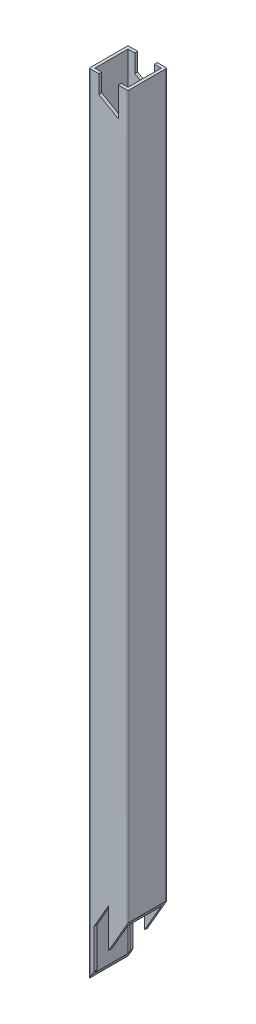
ISO-10303-21;
HEADER;
FILE_DESCRIPTION(('STEP AP214'),'2;1');
FILE_NAME('part.step','',(''),(''),'','','');
FILE_SCHEMA(('AUTOMOTIVE_DESIGN { 1 0 10303 214 1 1 1 1 }'));
ENDSEC;
DATA;
#1=APPLICATION_CONTEXT('core data for automotive mechanical design processes');
#2=APPLICATION_PROTOCOL_DEFINITION('international standard','automotive_design',2000,#1);
#3=PRODUCT_CONTEXT('',#1,'mechanical');
#4=PRODUCT('Part','Part','',(#3));
#5=PRODUCT_RELATED_PRODUCT_CATEGORY('part','',(#4));
#6=PRODUCT_DEFINITION_FORMATION('','',#4);
#7=PRODUCT_DEFINITION_CONTEXT('part definition',#1,'design');
#8=PRODUCT_DEFINITION('design','',#6,#7);
#9=PRODUCT_DEFINITION_SHAPE('','',#8);
#10=(LENGTH_UNIT() NAMED_UNIT(*) SI_UNIT(.MILLI.,.METRE.));
#11=(NAMED_UNIT(*) PLANE_ANGLE_UNIT() SI_UNIT($,.RADIAN.));
#12=(NAMED_UNIT(*) SI_UNIT($,.STERADIAN.) SOLID_ANGLE_UNIT());
#13=UNCERTAINTY_MEASURE_WITH_UNIT(LENGTH_MEASURE(1.E-05),#10,'distance_accuracy_value','');
#14=(GEOMETRIC_REPRESENTATION_CONTEXT(3) GLOBAL_UNCERTAINTY_ASSIGNED_CONTEXT((#13)) GLOBAL_UNIT_ASSIGNED_CONTEXT((#10,
#11,#12)) REPRESENTATION_CONTEXT('',''));
#15=CARTESIAN_POINT('',(0.,0.,0.));
#16=DIRECTION('',(0.,0.,1.));
#17=DIRECTION('',(1.,0.,0.));
#18=AXIS2_PLACEMENT_3D('',#15,#16,#17);
#19=CARTESIAN_POINT('',(20.,34.6410161513772,-20.));
#20=DIRECTION('',(-0.866025403784436,0.500000000000004,0.));
#21=DIRECTION('',(-0.500000000000004,-0.866025403784436,0.));
#22=AXIS2_PLACEMENT_3D('',#19,#20,#21);
#23=PLANE('',#22);
#24=DIRECTION('',(-0.500000000000004,-0.866025403784436,0.));
#25=VECTOR('',#24,1.);
#26=CARTESIAN_POINT('',(20.,34.6410161513772,0.));
#27=LINE('',#26,#25);
#28=CARTESIAN_POINT('',(19.5,33.7749907475929,0.));
#29=VERTEX_POINT('',#28);
#30=CARTESIAN_POINT('',(10.0900000000002,17.4763926483699,0.));
#31=VERTEX_POINT('',#30);
#32=EDGE_CURVE('E276',#29,#31,#27,.T.);
#33=ORIENTED_EDGE('',*,*,#32,.T.);
#34=DIRECTION('',(0.,0.,-1.));
#35=VECTOR('',#34,1.);
#36=CARTESIAN_POINT('',(10.0900000000002,17.4763926483699,0.));
#37=LINE('',#36,#35);
#38=CARTESIAN_POINT('',(10.0900000000002,17.4763926483699,-1.5));
#39=VERTEX_POINT('',#38);
#40=EDGE_CURVE('E258',#31,#39,#37,.T.);
#41=ORIENTED_EDGE('',*,*,#40,.T.);
#42=DIRECTION('',(0.500000000000004,0.866025403784436,0.));
#43=VECTOR('',#42,1.);
#44=CARTESIAN_POINT('',(175.74514426635,304.399519052837,-1.5));
#45=LINE('',#44,#43);
#46=CARTESIAN_POINT('',(18.5,32.0429399400239,-1.5));
#47=VERTEX_POINT('',#46);
#48=EDGE_CURVE('E282',#39,#47,#45,.T.);
#49=ORIENTED_EDGE('',*,*,#48,.T.);
#50=DIRECTION('',(0.,0.,-1.));
#51=VECTOR('',#50,1.);
#52=CARTESIAN_POINT('',(18.5,32.0429399400239,-1.5));
#53=LINE('',#52,#51);
#54=CARTESIAN_POINT('',(18.5,32.042939940024,-18.5));
#55=VERTEX_POINT('',#54);
#56=EDGE_CURVE('E280',#47,#55,#53,.T.);
#57=ORIENTED_EDGE('',*,*,#56,.T.);
#58=DIRECTION('',(-0.500000000000004,-0.866025403784436,0.));
#59=VECTOR('',#58,1.);
#60=CARTESIAN_POINT('',(175.74514426635,304.399519052837,-18.5));
#61=LINE('',#60,#59);
#62=CARTESIAN_POINT('',(10.0900000000002,17.4763926483699,-18.5));
#63=VERTEX_POINT('',#62);
#64=EDGE_CURVE('E418',#55,#63,#61,.T.);
#65=ORIENTED_EDGE('',*,*,#64,.T.);
#66=DIRECTION('',(0.,0.,-1.));
#67=VECTOR('',#66,1.);
#68=CARTESIAN_POINT('',(10.0900000000002,17.4763926483701,-20.));
#69=LINE('',#68,#67);
#70=CARTESIAN_POINT('',(10.0900000000002,17.4763926483699,-20.));
#71=VERTEX_POINT('',#70);
#72=EDGE_CURVE('E47',#63,#71,#69,.T.);
#73=ORIENTED_EDGE('',*,*,#72,.T.);
#74=DIRECTION('',(-0.500000000000004,-0.866025403784436,0.));
#75=VECTOR('',#74,1.);
#76=CARTESIAN_POINT('',(20.,34.6410161513772,-20.));
#77=LINE('',#76,#75);
#78=CARTESIAN_POINT('',(19.5,33.7749907475928,-20.));
#79=VERTEX_POINT('',#78);
#80=EDGE_CURVE('E271',#79,#71,#77,.T.);
#81=ORIENTED_EDGE('',*,*,#80,.F.);
#82=CARTESIAN_POINT('',(19.5,33.7749907475927,-19.5));
#83=DIRECTION('',(-0.866025403784436,0.500000000000004,0.));
#84=DIRECTION('',(-0.500000000000004,-0.866025403784436,0.));
#85=AXIS2_PLACEMENT_3D('',#82,#83,#84);
#86=ELLIPSE('',#85,0.999999999999993,0.5);
#87=CARTESIAN_POINT('',(20.,34.6410161513772,-19.5));
#88=VERTEX_POINT('',#87);
#89=EDGE_CURVE('E294',#88,#79,#86,.T.);
#90=ORIENTED_EDGE('',*,*,#89,.F.);
#91=DIRECTION('',(0.,0.,1.));
#92=VECTOR('',#91,1.);
#93=CARTESIAN_POINT('',(20.,34.6410161513772,-20.));
#94=LINE('',#93,#92);
#95=CARTESIAN_POINT('',(20.,34.6410161513772,-0.5));
#96=VERTEX_POINT('',#95);
#97=EDGE_CURVE('E274',#88,#96,#94,.T.);
#98=ORIENTED_EDGE('',*,*,#97,.T.);
#99=CARTESIAN_POINT('',(19.5,33.7749907475927,-0.5));
#100=DIRECTION('',(-0.866025403784436,0.500000000000004,0.));
#101=DIRECTION('',(-0.500000000000004,-0.866025403784436,0.));
#102=AXIS2_PLACEMENT_3D('',#99,#100,#101);
#103=ELLIPSE('',#102,0.999999999999992,0.5);
#104=EDGE_CURVE('E297',#29,#96,#103,.T.);
#105=ORIENTED_EDGE('',*,*,#104,.F.);
#106=EDGE_LOOP('',(#33,#41,#49,#57,#65,#73,#81,#90,#98,#105));
#107=FACE_BOUND('',#106,.T.);
#108=ADVANCED_FACE('F39',(#107),#23,.F.);
#109=CARTESIAN_POINT('',(19.5,405.,-0.5));
#110=DIRECTION('',(0.,1.,0.));
#111=DIRECTION('',(0.,0.,1.));
#112=AXIS2_PLACEMENT_3D('',#109,#110,#111);
#113=PLANE('',#112);
#114=DIRECTION('',(0.,0.,-1.));
#115=VECTOR('',#114,1.);
#116=CARTESIAN_POINT('',(5.,405.,0.));
#117=LINE('',#116,#115);
#118=CARTESIAN_POINT('',(5.,405.,-18.5));
#119=VERTEX_POINT('',#118);
#120=CARTESIAN_POINT('',(5.,405.,-20.));
#121=VERTEX_POINT('',#120);
#122=EDGE_CURVE('E322',#119,#121,#117,.T.);
#123=ORIENTED_EDGE('',*,*,#122,.T.);
#124=DIRECTION('',(-1.,0.,0.));
#125=VECTOR('',#124,1.);
#126=CARTESIAN_POINT('',(0.5,405.,-20.));
#127=LINE('',#126,#125);
#128=CARTESIAN_POINT('',(0.5,405.,-20.));
#129=VERTEX_POINT('',#128);
#130=EDGE_CURVE('E371',#121,#129,#127,.T.);
#131=ORIENTED_EDGE('',*,*,#130,.T.);
#132=CARTESIAN_POINT('',(0.5,405.,-19.5));
#133=DIRECTION('',(0.,1.,0.));
#134=DIRECTION('',(0.,0.,-1.));
#135=AXIS2_PLACEMENT_3D('',#132,#133,#134);
#136=CIRCLE('',#135,0.5);
#137=CARTESIAN_POINT('',(0.,405.,-19.5));
#138=VERTEX_POINT('',#137);
#139=EDGE_CURVE('E375',#129,#138,#136,.T.);
#140=ORIENTED_EDGE('',*,*,#139,.T.);
#141=DIRECTION('',(0.,0.,1.));
#142=VECTOR('',#141,1.);
#143=CARTESIAN_POINT('',(0.,405.,-0.500000000000004));
#144=LINE('',#143,#142);
#145=CARTESIAN_POINT('',(0.,405.,-0.500000000000003));
#146=VERTEX_POINT('',#145);
#147=EDGE_CURVE('E377',#138,#146,#144,.T.);
#148=ORIENTED_EDGE('',*,*,#147,.T.);
#149=CARTESIAN_POINT('',(0.5,405.,-0.5));
#150=DIRECTION('',(0.,1.,0.));
#151=DIRECTION('',(0.,0.,-1.));
#152=AXIS2_PLACEMENT_3D('',#149,#150,#151);
#153=CIRCLE('',#152,0.5);
#154=CARTESIAN_POINT('',(0.500000000000004,405.,0.));
#155=VERTEX_POINT('',#154);
#156=EDGE_CURVE('E379',#146,#155,#153,.T.);
#157=ORIENTED_EDGE('',*,*,#156,.T.);
#158=DIRECTION('',(1.,0.,0.));
#159=VECTOR('',#158,1.);
#160=CARTESIAN_POINT('',(0.500000000000004,405.,0.));
#161=LINE('',#160,#159);
#162=CARTESIAN_POINT('',(5.,405.,0.));
#163=VERTEX_POINT('',#162);
#164=EDGE_CURVE('E382',#155,#163,#161,.T.);
#165=ORIENTED_EDGE('',*,*,#164,.T.);
#166=CARTESIAN_POINT('',(5.,405.,-1.5));
#167=VERTEX_POINT('',#166);
#168=EDGE_CURVE('E318',#163,#167,#117,.T.);
#169=ORIENTED_EDGE('',*,*,#168,.T.);
#170=DIRECTION('',(1.,0.,0.));
#171=VECTOR('',#170,1.);
#172=CARTESIAN_POINT('',(1.5,405.,-1.5));
#173=LINE('',#172,#171);
#174=CARTESIAN_POINT('',(1.5,405.,-1.5));
#175=VERTEX_POINT('',#174);
#176=EDGE_CURVE('E341',#175,#167,#173,.T.);
#177=ORIENTED_EDGE('',*,*,#176,.F.);
#178=DIRECTION('',(0.,0.,1.));
#179=VECTOR('',#178,1.);
#180=CARTESIAN_POINT('',(1.5,405.,-1.5));
#181=LINE('',#180,#179);
#182=CARTESIAN_POINT('',(1.5,405.,-18.5));
#183=VERTEX_POINT('',#182);
#184=EDGE_CURVE('E338',#183,#175,#181,.T.);
#185=ORIENTED_EDGE('',*,*,#184,.F.);
#186=DIRECTION('',(-1.,0.,0.));
#187=VECTOR('',#186,1.);
#188=CARTESIAN_POINT('',(1.5,405.,-18.5));
#189=LINE('',#188,#187);
#190=EDGE_CURVE('E347',#119,#183,#189,.T.);
#191=ORIENTED_EDGE('',*,*,#190,.F.);
#192=EDGE_LOOP('',(#123,#131,#140,#148,#157,#165,#169,#177,#185,#191));
#193=FACE_BOUND('',#192,.T.);
#194=ADVANCED_FACE('F490',(#193),#113,.T.);
#195=DIRECTION('',(0.,0.,-1.));
#196=VECTOR('',#195,1.);
#197=CARTESIAN_POINT('',(15.,405.,0.));
#198=LINE('',#197,#196);
#199=CARTESIAN_POINT('',(15.,405.,0.));
#200=VERTEX_POINT('',#199);
#201=CARTESIAN_POINT('',(15.,405.,-1.5));
#202=VERTEX_POINT('',#201);
#203=EDGE_CURVE('E331',#200,#202,#198,.T.);
#204=ORIENTED_EDGE('',*,*,#203,.F.);
#205=CARTESIAN_POINT('',(19.5,405.,0.));
#206=VERTEX_POINT('',#205);
#207=EDGE_CURVE('E381',#200,#206,#161,.T.);
#208=ORIENTED_EDGE('',*,*,#207,.T.);
#209=CARTESIAN_POINT('',(19.5,405.,-0.5));
#210=DIRECTION('',(0.,1.,0.));
#211=DIRECTION('',(0.,0.,1.));
#212=AXIS2_PLACEMENT_3D('',#209,#210,#211);
#213=CIRCLE('',#212,0.5);
#214=CARTESIAN_POINT('',(20.,405.,-0.5));
#215=VERTEX_POINT('',#214);
#216=EDGE_CURVE('E364',#206,#215,#213,.T.);
#217=ORIENTED_EDGE('',*,*,#216,.T.);
#218=DIRECTION('',(0.,0.,-1.));
#219=VECTOR('',#218,1.);
#220=CARTESIAN_POINT('',(20.,405.,-0.5));
#221=LINE('',#220,#219);
#222=CARTESIAN_POINT('',(20.,405.,-19.5));
#223=VERTEX_POINT('',#222);
#224=EDGE_CURVE('E367',#215,#223,#221,.T.);
#225=ORIENTED_EDGE('',*,*,#224,.T.);
#226=CARTESIAN_POINT('',(19.5,405.,-19.5));
#227=DIRECTION('',(0.,1.,0.));
#228=DIRECTION('',(0.,0.,-1.));
#229=AXIS2_PLACEMENT_3D('',#226,#227,#228);
#230=CIRCLE('',#229,0.5);
#231=CARTESIAN_POINT('',(19.5,405.,-20.));
#232=VERTEX_POINT('',#231);
#233=EDGE_CURVE('E369',#223,#232,#230,.T.);
#234=ORIENTED_EDGE('',*,*,#233,.T.);
#235=CARTESIAN_POINT('',(15.,405.,-20.));
#236=VERTEX_POINT('',#235);
#237=EDGE_CURVE('E372',#232,#236,#127,.T.);
#238=ORIENTED_EDGE('',*,*,#237,.T.);
#239=CARTESIAN_POINT('',(15.,405.,-18.5));
#240=VERTEX_POINT('',#239);
#241=EDGE_CURVE('E311',#240,#236,#198,.T.);
#242=ORIENTED_EDGE('',*,*,#241,.F.);
#243=CARTESIAN_POINT('',(18.5,405.,-18.5));
#244=VERTEX_POINT('',#243);
#245=EDGE_CURVE('E348',#244,#240,#189,.T.);
#246=ORIENTED_EDGE('',*,*,#245,.F.);
#247=DIRECTION('',(0.,0.,-1.));
#248=VECTOR('',#247,1.);
#249=CARTESIAN_POINT('',(18.5,405.,-1.5));
#250=LINE('',#249,#248);
#251=CARTESIAN_POINT('',(18.5,405.,-1.5));
#252=VERTEX_POINT('',#251);
#253=EDGE_CURVE('E344',#252,#244,#250,.T.);
#254=ORIENTED_EDGE('',*,*,#253,.F.);
#255=EDGE_CURVE('E340',#202,#252,#173,.T.);
#256=ORIENTED_EDGE('',*,*,#255,.F.);
#257=EDGE_LOOP('',(#204,#208,#217,#225,#234,#238,#242,#246,#254,#256));
#258=FACE_BOUND('',#257,.T.);
#259=ADVANCED_FACE('F463',(#258),#113,.T.);
#260=CARTESIAN_POINT('',(19.5,405.,-0.5));
#261=DIRECTION('',(0.,-1.,0.));
#262=DIRECTION('',(0.,0.,-1.));
#263=AXIS2_PLACEMENT_3D('',#260,#261,#262);
#264=CYLINDRICAL_SURFACE('',#263,0.5);
#265=DIRECTION('',(0.,-1.,0.));
#266=VECTOR('',#265,1.);
#267=CARTESIAN_POINT('',(19.5,405.,0.));
#268=LINE('',#267,#266);
#269=EDGE_CURVE('E385',#206,#29,#268,.T.);
#270=ORIENTED_EDGE('',*,*,#269,.T.);
#271=ORIENTED_EDGE('',*,*,#104,.T.);
#272=DIRECTION('',(0.,-1.,0.));
#273=VECTOR('',#272,1.);
#274=CARTESIAN_POINT('',(20.,405.,-0.5));
#275=LINE('',#274,#273);
#276=EDGE_CURVE('E407',#215,#96,#275,.T.);
#277=ORIENTED_EDGE('',*,*,#276,.F.);
#278=ORIENTED_EDGE('',*,*,#216,.F.);
#279=EDGE_LOOP('',(#270,#271,#277,#278));
#280=FACE_BOUND('',#279,.T.);
#281=ADVANCED_FACE('F41',(#280),#264,.T.);
#282=CARTESIAN_POINT('',(20.,405.,-0.5));
#283=DIRECTION('',(-1.,0.,0.));
#284=DIRECTION('',(0.,0.,1.));
#285=AXIS2_PLACEMENT_3D('',#282,#283,#284);
#286=PLANE('',#285);
#287=ORIENTED_EDGE('',*,*,#276,.T.);
#288=ORIENTED_EDGE('',*,*,#97,.F.);
#289=DIRECTION('',(0.,-1.,0.));
#290=VECTOR('',#289,1.);
#291=CARTESIAN_POINT('',(20.,405.,-19.5));
#292=LINE('',#291,#290);
#293=EDGE_CURVE('E404',#223,#88,#292,.T.);
#294=ORIENTED_EDGE('',*,*,#293,.F.);
#295=ORIENTED_EDGE('',*,*,#224,.F.);
#296=EDGE_LOOP('',(#287,#288,#294,#295));
#297=FACE_BOUND('',#296,.T.);
#298=ADVANCED_FACE('F440',(#297),#286,.F.);
#299=CARTESIAN_POINT('',(19.5,405.,-19.5));
#300=DIRECTION('',(0.,-1.,0.));
#301=DIRECTION('',(0.,0.,-1.));
#302=AXIS2_PLACEMENT_3D('',#299,#300,#301);
#303=CYLINDRICAL_SURFACE('',#302,0.5);
#304=ORIENTED_EDGE('',*,*,#293,.T.);
#305=ORIENTED_EDGE('',*,*,#89,.T.);
#306=DIRECTION('',(0.,-1.,0.));
#307=VECTOR('',#306,1.);
#308=CARTESIAN_POINT('',(19.5,405.,-20.));
#309=LINE('',#308,#307);
#310=EDGE_CURVE('E401',#232,#79,#309,.T.);
#311=ORIENTED_EDGE('',*,*,#310,.F.);
#312=ORIENTED_EDGE('',*,*,#233,.F.);
#313=EDGE_LOOP('',(#304,#305,#311,#312));
#314=FACE_BOUND('',#313,.T.);
#315=ADVANCED_FACE('F436',(#314),#303,.T.);
#316=CARTESIAN_POINT('',(0.5,405.,-20.));
#317=DIRECTION('',(0.,0.,1.));
#318=DIRECTION('',(1.,0.,0.));
#319=AXIS2_PLACEMENT_3D('',#316,#317,#318);
#320=PLANE('',#319);
#321=ORIENTED_EDGE('',*,*,#80,.T.);
#322=DIRECTION('',(0.,-1.,0.));
#323=VECTOR('',#322,1.);
#324=CARTESIAN_POINT('',(10.0900000000003,37.4763926483701,-20.));
#325=LINE('',#324,#323);
#326=CARTESIAN_POINT('',(10.0900000000003,37.4763926483701,-20.));
#327=VERTEX_POINT('',#326);
#328=EDGE_CURVE('E246',#327,#71,#325,.T.);
#329=ORIENTED_EDGE('',*,*,#328,.F.);
#330=DIRECTION('',(0.5,0.866025403784438,0.));
#331=VECTOR('',#330,1.);
#332=CARTESIAN_POINT('',(2.59000000000028,24.4860115916035,-20.));
#333=LINE('',#332,#331);
#334=CARTESIAN_POINT('',(2.59000000000028,24.4860115916035,-20.));
#335=VERTEX_POINT('',#334);
#336=EDGE_CURVE('E248',#335,#327,#333,.T.);
#337=ORIENTED_EDGE('',*,*,#336,.F.);
#338=DIRECTION('',(0.,1.,0.));
#339=VECTOR('',#338,1.);
#340=CARTESIAN_POINT('',(2.59000000000015,4.4860115916033,-20.));
#341=LINE('',#340,#339);
#342=CARTESIAN_POINT('',(2.59000000000015,4.4860115916033,-20.));
#343=VERTEX_POINT('',#342);
#344=EDGE_CURVE('E253',#343,#335,#341,.T.);
#345=ORIENTED_EDGE('',*,*,#344,.F.);
#346=CARTESIAN_POINT('',(0.499999999999985,0.866025403784384,-20.));
#347=VERTEX_POINT('',#346);
#348=EDGE_CURVE('E275',#343,#347,#77,.T.);
#349=ORIENTED_EDGE('',*,*,#348,.T.);
#350=DIRECTION('',(0.,-1.,0.));
#351=VECTOR('',#350,1.);
#352=CARTESIAN_POINT('',(0.5,405.,-20.));
#353=LINE('',#352,#351);
#354=EDGE_CURVE('E398',#129,#347,#353,.T.);
#355=ORIENTED_EDGE('',*,*,#354,.F.);
#356=ORIENTED_EDGE('',*,*,#130,.F.);
#357=DIRECTION('',(0.,1.,0.));
#358=VECTOR('',#357,1.);
#359=CARTESIAN_POINT('',(5.,405.,-20.));
#360=LINE('',#359,#358);
#361=CARTESIAN_POINT('',(5.,395.773502691896,-20.));
#362=VERTEX_POINT('',#361);
#363=EDGE_CURVE('E305',#362,#121,#360,.T.);
#364=ORIENTED_EDGE('',*,*,#363,.F.);
#365=DIRECTION('',(-0.866025403784439,0.5,0.));
#366=VECTOR('',#365,1.);
#367=CARTESIAN_POINT('',(15.,390.,-20.));
#368=LINE('',#367,#366);
#369=CARTESIAN_POINT('',(15.,390.,-20.));
#370=VERTEX_POINT('',#369);
#371=EDGE_CURVE('E314',#370,#362,#368,.T.);
#372=ORIENTED_EDGE('',*,*,#371,.F.);
#373=DIRECTION('',(0.,-1.,0.));
#374=VECTOR('',#373,1.);
#375=CARTESIAN_POINT('',(15.,390.,-20.));
#376=LINE('',#375,#374);
#377=EDGE_CURVE('E300',#236,#370,#376,.T.);
#378=ORIENTED_EDGE('',*,*,#377,.F.);
#379=ORIENTED_EDGE('',*,*,#237,.F.);
#380=ORIENTED_EDGE('',*,*,#310,.T.);
#381=EDGE_LOOP('',(#321,#329,#337,#345,#349,#355,#356,#364,#372,#378,#379,#380));
#382=FACE_BOUND('',#381,.T.);
#383=ADVANCED_FACE('F429',(#382),#320,.F.);
#384=CARTESIAN_POINT('',(0.5,405.,-19.5));
#385=DIRECTION('',(0.,-1.,0.));
#386=DIRECTION('',(0.,0.,-1.));
#387=AXIS2_PLACEMENT_3D('',#384,#385,#386);
#388=CYLINDRICAL_SURFACE('',#387,0.5);
#389=ORIENTED_EDGE('',*,*,#354,.T.);
#390=CARTESIAN_POINT('',(0.5,0.866025403784443,-19.5));
#391=DIRECTION('',(-0.866025403784436,0.500000000000004,0.));
#392=DIRECTION('',(-0.500000000000004,-0.866025403784436,0.));
#393=AXIS2_PLACEMENT_3D('',#390,#391,#392);
#394=ELLIPSE('',#393,0.999999999999992,0.5);
#395=CARTESIAN_POINT('',(0.,0.,-19.5));
#396=VERTEX_POINT('',#395);
#397=EDGE_CURVE('E291',#347,#396,#394,.T.);
#398=ORIENTED_EDGE('',*,*,#397,.T.);
#399=DIRECTION('',(0.,-1.,0.));
#400=VECTOR('',#399,1.);
#401=CARTESIAN_POINT('',(0.,405.,-19.5));
#402=LINE('',#401,#400);
#403=EDGE_CURVE('E395',#138,#396,#402,.T.);
#404=ORIENTED_EDGE('',*,*,#403,.F.);
#405=ORIENTED_EDGE('',*,*,#139,.F.);
#406=EDGE_LOOP('',(#389,#398,#404,#405));
#407=FACE_BOUND('',#406,.T.);
#408=ADVANCED_FACE('F484',(#407),#388,.T.);
#409=CARTESIAN_POINT('',(0.,405.,-0.500000000000004));
#410=DIRECTION('',(1.,0.,0.));
#411=DIRECTION('',(0.,0.,-1.));
#412=AXIS2_PLACEMENT_3D('',#409,#410,#411);
#413=PLANE('',#412);
#414=DIRECTION('',(0.,0.,1.));
#415=VECTOR('',#414,1.);
#416=CARTESIAN_POINT('',(0.,0.,-0.500000000000004));
#417=LINE('',#416,#415);
#418=CARTESIAN_POINT('',(0.,0.,-0.5));
#419=VERTEX_POINT('',#418);
#420=EDGE_CURVE('E363',#396,#419,#417,.T.);
#421=ORIENTED_EDGE('',*,*,#420,.T.);
#422=DIRECTION('',(0.,-1.,0.));
#423=VECTOR('',#422,1.);
#424=CARTESIAN_POINT('',(0.,405.,-0.500000000000003));
#425=LINE('',#424,#423);
#426=EDGE_CURVE('E392',#146,#419,#425,.T.);
#427=ORIENTED_EDGE('',*,*,#426,.F.);
#428=ORIENTED_EDGE('',*,*,#147,.F.);
#429=ORIENTED_EDGE('',*,*,#403,.T.);
#430=EDGE_LOOP('',(#421,#427,#428,#429));
#431=FACE_BOUND('',#430,.T.);
#432=ADVANCED_FACE('F520',(#431),#413,.F.);
#433=CARTESIAN_POINT('',(0.5,405.,-0.5));
#434=DIRECTION('',(0.,-1.,0.));
#435=DIRECTION('',(0.,0.,-1.));
#436=AXIS2_PLACEMENT_3D('',#433,#434,#435);
#437=CYLINDRICAL_SURFACE('',#436,0.5);
#438=ORIENTED_EDGE('',*,*,#426,.T.);
#439=CARTESIAN_POINT('',(0.5,0.866025403784443,-0.5));
#440=DIRECTION('',(-0.866025403784436,0.500000000000004,0.));
#441=DIRECTION('',(-0.500000000000004,-0.866025403784436,0.));
#442=AXIS2_PLACEMENT_3D('',#439,#440,#441);
#443=ELLIPSE('',#442,0.999999999999992,0.5);
#444=CARTESIAN_POINT('',(0.500000000000032,0.866025403784484,0.));
#445=VERTEX_POINT('',#444);
#446=EDGE_CURVE('E288',#419,#445,#443,.T.);
#447=ORIENTED_EDGE('',*,*,#446,.T.);
#448=DIRECTION('',(0.,-1.,0.));
#449=VECTOR('',#448,1.);
#450=CARTESIAN_POINT('',(0.500000000000004,405.,0.));
#451=LINE('',#450,#449);
#452=EDGE_CURVE('E390',#155,#445,#451,.T.);
#453=ORIENTED_EDGE('',*,*,#452,.F.);
#454=ORIENTED_EDGE('',*,*,#156,.F.);
#455=EDGE_LOOP('',(#438,#447,#453,#454));
#456=FACE_BOUND('',#455,.T.);
#457=ADVANCED_FACE('F518',(#456),#437,.T.);
#458=CARTESIAN_POINT('',(0.500000000000004,405.,0.));
#459=DIRECTION('',(0.,0.,-1.));
#460=DIRECTION('',(-1.,0.,0.));
#461=AXIS2_PLACEMENT_3D('',#458,#459,#460);
#462=PLANE('',#461);
#463=DIRECTION('',(0.5,0.866025403784438,0.));
#464=VECTOR('',#463,1.);
#465=CARTESIAN_POINT('',(2.59000000000028,24.4860115916035,0.));
#466=LINE('',#465,#464);
#467=CARTESIAN_POINT('',(2.59000000000028,24.4860115916035,0.));
#468=VERTEX_POINT('',#467);
#469=CARTESIAN_POINT('',(10.0900000000003,37.4763926483701,0.));
#470=VERTEX_POINT('',#469);
#471=EDGE_CURVE('E233',#468,#470,#466,.T.);
#472=ORIENTED_EDGE('',*,*,#471,.T.);
#473=DIRECTION('',(0.,-1.,0.));
#474=VECTOR('',#473,1.);
#475=CARTESIAN_POINT('',(10.0900000000003,37.4763926483701,0.));
#476=LINE('',#475,#474);
#477=EDGE_CURVE('E240',#470,#31,#476,.T.);
#478=ORIENTED_EDGE('',*,*,#477,.T.);
#479=ORIENTED_EDGE('',*,*,#32,.F.);
#480=ORIENTED_EDGE('',*,*,#269,.F.);
#481=ORIENTED_EDGE('',*,*,#207,.F.);
#482=DIRECTION('',(0.,-1.,0.));
#483=VECTOR('',#482,1.);
#484=CARTESIAN_POINT('',(15.,390.,0.));
#485=LINE('',#484,#483);
#486=CARTESIAN_POINT('',(15.,390.,0.));
#487=VERTEX_POINT('',#486);
#488=EDGE_CURVE('E301',#200,#487,#485,.T.);
#489=ORIENTED_EDGE('',*,*,#488,.T.);
#490=DIRECTION('',(-0.866025403784439,0.5,0.));
#491=VECTOR('',#490,1.);
#492=CARTESIAN_POINT('',(15.,390.,0.));
#493=LINE('',#492,#491);
#494=CARTESIAN_POINT('',(5.,395.773502691896,0.));
#495=VERTEX_POINT('',#494);
#496=EDGE_CURVE('E304',#487,#495,#493,.T.);
#497=ORIENTED_EDGE('',*,*,#496,.T.);
#498=DIRECTION('',(0.,1.,0.));
#499=VECTOR('',#498,1.);
#500=CARTESIAN_POINT('',(5.,405.,0.));
#501=LINE('',#500,#499);
#502=EDGE_CURVE('E308',#495,#163,#501,.T.);
#503=ORIENTED_EDGE('',*,*,#502,.T.);
#504=ORIENTED_EDGE('',*,*,#164,.F.);
#505=ORIENTED_EDGE('',*,*,#452,.T.);
#506=CARTESIAN_POINT('',(2.58999999999998,4.48601159160331,0.));
#507=VERTEX_POINT('',#506);
#508=EDGE_CURVE('E245',#507,#445,#27,.T.);
#509=ORIENTED_EDGE('',*,*,#508,.F.);
#510=DIRECTION('',(0.,1.,0.));
#511=VECTOR('',#510,1.);
#512=CARTESIAN_POINT('',(2.59000000000015,4.4860115916033,0.));
#513=LINE('',#512,#511);
#514=EDGE_CURVE('E54',#507,#468,#513,.T.);
#515=ORIENTED_EDGE('',*,*,#514,.T.);
#516=EDGE_LOOP('',(#472,#478,#479,#480,#481,#489,#497,#503,#504,#505,#509,#515));
#517=FACE_BOUND('',#516,.T.);
#518=ADVANCED_FACE('F243',(#517),#462,.F.);
#519=CARTESIAN_POINT('',(1.5,405.,-1.5));
#520=DIRECTION('',(1.,0.,0.));
#521=DIRECTION('',(0.,0.,-1.));
#522=AXIS2_PLACEMENT_3D('',#519,#520,#521);
#523=PLANE('',#522);
#524=DIRECTION('',(0.,0.,1.));
#525=VECTOR('',#524,1.);
#526=CARTESIAN_POINT('',(1.5,2.59807621135333,-1.5));
#527=LINE('',#526,#525);
#528=CARTESIAN_POINT('',(1.5,2.59807621135338,-18.5));
#529=VERTEX_POINT('',#528);
#530=CARTESIAN_POINT('',(1.5,2.59807621135338,-1.5));
#531=VERTEX_POINT('',#530);
#532=EDGE_CURVE('E286',#529,#531,#527,.T.);
#533=ORIENTED_EDGE('',*,*,#532,.F.);
#534=DIRECTION('',(0.,-1.,0.));
#535=VECTOR('',#534,1.);
#536=CARTESIAN_POINT('',(1.5,405.,-18.5));
#537=LINE('',#536,#535);
#538=EDGE_CURVE('E351',#183,#529,#537,.T.);
#539=ORIENTED_EDGE('',*,*,#538,.F.);
#540=ORIENTED_EDGE('',*,*,#184,.T.);
#541=DIRECTION('',(0.,-1.,0.));
#542=VECTOR('',#541,1.);
#543=CARTESIAN_POINT('',(1.5,405.,-1.5));
#544=LINE('',#543,#542);
#545=EDGE_CURVE('E360',#175,#531,#544,.T.);
#546=ORIENTED_EDGE('',*,*,#545,.T.);
#547=EDGE_LOOP('',(#533,#539,#540,#546));
#548=FACE_BOUND('',#547,.T.);
#549=ADVANCED_FACE('F564',(#548),#523,.T.);
#550=CARTESIAN_POINT('',(1.5,405.,-1.5));
#551=DIRECTION('',(0.,0.,-1.));
#552=DIRECTION('',(-1.,0.,0.));
#553=AXIS2_PLACEMENT_3D('',#550,#551,#552);
#554=PLANE('',#553);
#555=DIRECTION('',(0.,-1.,0.));
#556=VECTOR('',#555,1.);
#557=CARTESIAN_POINT('',(10.0900000000026,405.,-1.5));
#558=LINE('',#557,#556);
#559=CARTESIAN_POINT('',(10.0900000000003,37.4763926483701,-1.5));
#560=VERTEX_POINT('',#559);
#561=EDGE_CURVE('E267',#560,#39,#558,.T.);
#562=ORIENTED_EDGE('',*,*,#561,.F.);
#563=DIRECTION('',(0.5,0.866025403784439,0.));
#564=VECTOR('',#563,1.);
#565=CARTESIAN_POINT('',(167.084890228505,309.399519052838,-1.5));
#566=LINE('',#565,#564);
#567=CARTESIAN_POINT('',(2.59000000000028,24.4860115916035,-1.5));
#568=VERTEX_POINT('',#567);
#569=EDGE_CURVE('E269',#568,#560,#566,.T.);
#570=ORIENTED_EDGE('',*,*,#569,.F.);
#571=DIRECTION('',(0.,1.,0.));
#572=VECTOR('',#571,1.);
#573=CARTESIAN_POINT('',(2.5900000000026,405.,-1.5));
#574=LINE('',#573,#572);
#575=CARTESIAN_POINT('',(2.59000000000015,4.4860115916033,-1.5));
#576=VERTEX_POINT('',#575);
#577=EDGE_CURVE('E226',#576,#568,#574,.T.);
#578=ORIENTED_EDGE('',*,*,#577,.F.);
#579=EDGE_CURVE('E283',#531,#576,#45,.T.);
#580=ORIENTED_EDGE('',*,*,#579,.F.);
#581=ORIENTED_EDGE('',*,*,#545,.F.);
#582=ORIENTED_EDGE('',*,*,#176,.T.);
#583=DIRECTION('',(0.,1.,0.));
#584=VECTOR('',#583,1.);
#585=CARTESIAN_POINT('',(5.,405.,-1.5));
#586=LINE('',#585,#584);
#587=CARTESIAN_POINT('',(5.,395.773502691896,-1.5));
#588=VERTEX_POINT('',#587);
#589=EDGE_CURVE('E336',#588,#167,#586,.T.);
#590=ORIENTED_EDGE('',*,*,#589,.F.);
#591=DIRECTION('',(-0.866025403784439,0.5,0.));
#592=VECTOR('',#591,1.);
#593=CARTESIAN_POINT('',(-1.6201905283833,399.595671475545,-1.5));
#594=LINE('',#593,#592);
#595=CARTESIAN_POINT('',(15.,390.,-1.5));
#596=VERTEX_POINT('',#595);
#597=EDGE_CURVE('E334',#596,#588,#594,.T.);
#598=ORIENTED_EDGE('',*,*,#597,.F.);
#599=DIRECTION('',(0.,-1.,0.));
#600=VECTOR('',#599,1.);
#601=CARTESIAN_POINT('',(15.,405.,-1.5));
#602=LINE('',#601,#600);
#603=EDGE_CURVE('E321',#202,#596,#602,.T.);
#604=ORIENTED_EDGE('',*,*,#603,.F.);
#605=ORIENTED_EDGE('',*,*,#255,.T.);
#606=DIRECTION('',(0.,-1.,0.));
#607=VECTOR('',#606,1.);
#608=CARTESIAN_POINT('',(18.5,405.,-1.5));
#609=LINE('',#608,#607);
#610=EDGE_CURVE('E357',#252,#47,#609,.T.);
#611=ORIENTED_EDGE('',*,*,#610,.T.);
#612=ORIENTED_EDGE('',*,*,#48,.F.);
#613=EDGE_LOOP('',(#562,#570,#578,#580,#581,#582,#590,#598,#604,#605,#611,#612));
#614=FACE_BOUND('',#613,.T.);
#615=ADVANCED_FACE('F453',(#614),#554,.T.);
#616=CARTESIAN_POINT('',(18.5,405.,-1.5));
#617=DIRECTION('',(-1.,0.,0.));
#618=DIRECTION('',(0.,0.,1.));
#619=AXIS2_PLACEMENT_3D('',#616,#617,#618);
#620=PLANE('',#619);
#621=ORIENTED_EDGE('',*,*,#56,.F.);
#622=ORIENTED_EDGE('',*,*,#610,.F.);
#623=ORIENTED_EDGE('',*,*,#253,.T.);
#624=DIRECTION('',(0.,-1.,0.));
#625=VECTOR('',#624,1.);
#626=CARTESIAN_POINT('',(18.5,405.,-18.5));
#627=LINE('',#626,#625);
#628=EDGE_CURVE('E354',#244,#55,#627,.T.);
#629=ORIENTED_EDGE('',*,*,#628,.T.);
#630=EDGE_LOOP('',(#621,#622,#623,#629));
#631=FACE_BOUND('',#630,.T.);
#632=ADVANCED_FACE('F459',(#631),#620,.T.);
#633=CARTESIAN_POINT('',(1.5,405.,-18.5));
#634=DIRECTION('',(0.,0.,1.));
#635=DIRECTION('',(1.,0.,0.));
#636=AXIS2_PLACEMENT_3D('',#633,#634,#635);
#637=PLANE('',#636);
#638=DIRECTION('',(0.,1.,0.));
#639=VECTOR('',#638,1.);
#640=CARTESIAN_POINT('',(10.0900000000026,405.,-18.5));
#641=LINE('',#640,#639);
#642=CARTESIAN_POINT('',(10.0900000000003,37.4763926483701,-18.5));
#643=VERTEX_POINT('',#642);
#644=EDGE_CURVE('E265',#63,#643,#641,.T.);
#645=ORIENTED_EDGE('',*,*,#644,.F.);
#646=ORIENTED_EDGE('',*,*,#64,.F.);
#647=ORIENTED_EDGE('',*,*,#628,.F.);
#648=ORIENTED_EDGE('',*,*,#245,.T.);
#649=DIRECTION('',(0.,1.,0.));
#650=VECTOR('',#649,1.);
#651=CARTESIAN_POINT('',(15.,405.,-18.5));
#652=LINE('',#651,#650);
#653=CARTESIAN_POINT('',(15.,390.,-18.5));
#654=VERTEX_POINT('',#653);
#655=EDGE_CURVE('E410',#654,#240,#652,.T.);
#656=ORIENTED_EDGE('',*,*,#655,.F.);
#657=DIRECTION('',(0.866025403784439,-0.5,0.));
#658=VECTOR('',#657,1.);
#659=CARTESIAN_POINT('',(-1.6201905283833,399.595671475545,-18.5));
#660=LINE('',#659,#658);
#661=CARTESIAN_POINT('',(5.,395.773502691896,-18.5));
#662=VERTEX_POINT('',#661);
#663=EDGE_CURVE('E412',#662,#654,#660,.T.);
#664=ORIENTED_EDGE('',*,*,#663,.F.);
#665=DIRECTION('',(0.,-1.,0.));
#666=VECTOR('',#665,1.);
#667=CARTESIAN_POINT('',(5.,405.,-18.5));
#668=LINE('',#667,#666);
#669=EDGE_CURVE('E415',#119,#662,#668,.T.);
#670=ORIENTED_EDGE('',*,*,#669,.F.);
#671=ORIENTED_EDGE('',*,*,#190,.T.);
#672=ORIENTED_EDGE('',*,*,#538,.T.);
#673=CARTESIAN_POINT('',(2.59000000000006,4.48601159160356,-18.5));
#674=VERTEX_POINT('',#673);
#675=EDGE_CURVE('E417',#674,#529,#61,.T.);
#676=ORIENTED_EDGE('',*,*,#675,.F.);
#677=DIRECTION('',(0.,-1.,0.));
#678=VECTOR('',#677,1.);
#679=CARTESIAN_POINT('',(2.5900000000026,405.,-18.5));
#680=LINE('',#679,#678);
#681=CARTESIAN_POINT('',(2.59000000000028,24.4860115916035,-18.5));
#682=VERTEX_POINT('',#681);
#683=EDGE_CURVE('E62',#682,#674,#680,.T.);
#684=ORIENTED_EDGE('',*,*,#683,.F.);
#685=DIRECTION('',(-0.5,-0.866025403784439,0.));
#686=VECTOR('',#685,1.);
#687=CARTESIAN_POINT('',(167.084890228505,309.399519052838,-18.5));
#688=LINE('',#687,#686);
#689=EDGE_CURVE('E11',#643,#682,#688,.T.);
#690=ORIENTED_EDGE('',*,*,#689,.F.);
#691=EDGE_LOOP('',(#645,#646,#647,#648,#656,#664,#670,#671,#672,#676,#684,#690));
#692=FACE_BOUND('',#691,.T.);
#693=ADVANCED_FACE('F467',(#692),#637,.T.);
#694=CARTESIAN_POINT('',(15.,390.,0.));
#695=DIRECTION('',(1.,0.,0.));
#696=DIRECTION('',(0.,1.,0.));
#697=AXIS2_PLACEMENT_3D('',#694,#695,#696);
#698=PLANE('',#697);
#699=ORIENTED_EDGE('',*,*,#655,.T.);
#700=ORIENTED_EDGE('',*,*,#241,.T.);
#701=ORIENTED_EDGE('',*,*,#377,.T.);
#702=DIRECTION('',(0.,0.,-1.));
#703=VECTOR('',#702,1.);
#704=CARTESIAN_POINT('',(15.,390.,0.));
#705=LINE('',#704,#703);
#706=EDGE_CURVE('E330',#654,#370,#705,.T.);
#707=ORIENTED_EDGE('',*,*,#706,.F.);
#708=EDGE_LOOP('',(#699,#700,#701,#707));
#709=FACE_BOUND('',#708,.T.);
#710=ADVANCED_FACE('F548',(#709),#698,.F.);
#711=CARTESIAN_POINT('',(15.,390.,0.));
#712=DIRECTION('',(-0.5,-0.866025403784439,0.));
#713=DIRECTION('',(0.866025403784439,-0.5,0.));
#714=AXIS2_PLACEMENT_3D('',#711,#712,#713);
#715=PLANE('',#714);
#716=ORIENTED_EDGE('',*,*,#663,.T.);
#717=ORIENTED_EDGE('',*,*,#706,.T.);
#718=ORIENTED_EDGE('',*,*,#371,.T.);
#719=DIRECTION('',(0.,0.,-1.));
#720=VECTOR('',#719,1.);
#721=CARTESIAN_POINT('',(5.,395.773502691896,0.));
#722=LINE('',#721,#720);
#723=EDGE_CURVE('E326',#662,#362,#722,.T.);
#724=ORIENTED_EDGE('',*,*,#723,.F.);
#725=EDGE_LOOP('',(#716,#717,#718,#724));
#726=FACE_BOUND('',#725,.T.);
#727=ADVANCED_FACE('F499',(#726),#715,.F.);
#728=CARTESIAN_POINT('',(5.,405.,0.));
#729=DIRECTION('',(-1.,0.,0.));
#730=DIRECTION('',(0.,0.,1.));
#731=AXIS2_PLACEMENT_3D('',#728,#729,#730);
#732=PLANE('',#731);
#733=ORIENTED_EDGE('',*,*,#669,.T.);
#734=ORIENTED_EDGE('',*,*,#723,.T.);
#735=ORIENTED_EDGE('',*,*,#363,.T.);
#736=ORIENTED_EDGE('',*,*,#122,.F.);
#737=EDGE_LOOP('',(#733,#734,#735,#736));
#738=FACE_BOUND('',#737,.T.);
#739=ADVANCED_FACE('F495',(#738),#732,.F.);
#740=ORIENTED_EDGE('',*,*,#589,.T.);
#741=ORIENTED_EDGE('',*,*,#168,.F.);
#742=ORIENTED_EDGE('',*,*,#502,.F.);
#743=EDGE_CURVE('E323',#495,#588,#722,.T.);
#744=ORIENTED_EDGE('',*,*,#743,.T.);
#745=EDGE_LOOP('',(#740,#741,#742,#744));
#746=FACE_BOUND('',#745,.T.);
#747=ADVANCED_FACE('F510',(#746),#732,.F.);
#748=ORIENTED_EDGE('',*,*,#597,.T.);
#749=ORIENTED_EDGE('',*,*,#743,.F.);
#750=ORIENTED_EDGE('',*,*,#496,.F.);
#751=EDGE_CURVE('E327',#487,#596,#705,.T.);
#752=ORIENTED_EDGE('',*,*,#751,.T.);
#753=EDGE_LOOP('',(#748,#749,#750,#752));
#754=FACE_BOUND('',#753,.T.);
#755=ADVANCED_FACE('F506',(#754),#715,.F.);
#756=ORIENTED_EDGE('',*,*,#603,.T.);
#757=ORIENTED_EDGE('',*,*,#751,.F.);
#758=ORIENTED_EDGE('',*,*,#488,.F.);
#759=ORIENTED_EDGE('',*,*,#203,.T.);
#760=EDGE_LOOP('',(#756,#757,#758,#759));
#761=FACE_BOUND('',#760,.T.);
#762=ADVANCED_FACE('F503',(#761),#698,.F.);
#763=ORIENTED_EDGE('',*,*,#348,.F.);
#764=DIRECTION('',(0.,0.,1.));
#765=VECTOR('',#764,1.);
#766=CARTESIAN_POINT('',(2.59000000000015,4.48601159160361,-20.));
#767=LINE('',#766,#765);
#768=EDGE_CURVE('E421',#343,#674,#767,.T.);
#769=ORIENTED_EDGE('',*,*,#768,.T.);
#770=ORIENTED_EDGE('',*,*,#675,.T.);
#771=ORIENTED_EDGE('',*,*,#532,.T.);
#772=ORIENTED_EDGE('',*,*,#579,.T.);
#773=DIRECTION('',(0.,0.,-1.));
#774=VECTOR('',#773,1.);
#775=CARTESIAN_POINT('',(2.59000000000015,4.4860115916033,0.));
#776=LINE('',#775,#774);
#777=EDGE_CURVE('E252',#507,#576,#776,.T.);
#778=ORIENTED_EDGE('',*,*,#777,.F.);
#779=ORIENTED_EDGE('',*,*,#508,.T.);
#780=ORIENTED_EDGE('',*,*,#446,.F.);
#781=ORIENTED_EDGE('',*,*,#420,.F.);
#782=ORIENTED_EDGE('',*,*,#397,.F.);
#783=EDGE_LOOP('',(#763,#769,#770,#771,#772,#778,#779,#780,#781,#782));
#784=FACE_BOUND('',#783,.T.);
#785=ADVANCED_FACE('F479',(#784),#23,.F.);
#786=CARTESIAN_POINT('',(10.0900000000003,37.4763926483701,0.));
#787=DIRECTION('',(1.,0.,0.));
#788=DIRECTION('',(0.,1.,0.));
#789=AXIS2_PLACEMENT_3D('',#786,#787,#788);
#790=PLANE('',#789);
#791=ORIENTED_EDGE('',*,*,#561,.T.);
#792=ORIENTED_EDGE('',*,*,#40,.F.);
#793=ORIENTED_EDGE('',*,*,#477,.F.);
#794=DIRECTION('',(0.,0.,-1.));
#795=VECTOR('',#794,1.);
#796=CARTESIAN_POINT('',(10.0900000000003,37.4763926483701,0.));
#797=LINE('',#796,#795);
#798=EDGE_CURVE('E236',#470,#560,#797,.T.);
#799=ORIENTED_EDGE('',*,*,#798,.T.);
#800=EDGE_LOOP('',(#791,#792,#793,#799));
#801=FACE_BOUND('',#800,.T.);
#802=ADVANCED_FACE('F448',(#801),#790,.F.);
#803=CARTESIAN_POINT('',(2.59000000000015,4.4860115916033,0.));
#804=DIRECTION('',(-1.,0.,0.));
#805=DIRECTION('',(0.,-1.,0.));
#806=AXIS2_PLACEMENT_3D('',#803,#804,#805);
#807=PLANE('',#806);
#808=ORIENTED_EDGE('',*,*,#577,.T.);
#809=DIRECTION('',(0.,0.,-1.));
#810=VECTOR('',#809,1.);
#811=CARTESIAN_POINT('',(2.59000000000028,24.4860115916035,0.));
#812=LINE('',#811,#810);
#813=EDGE_CURVE('E222',#468,#568,#812,.T.);
#814=ORIENTED_EDGE('',*,*,#813,.F.);
#815=ORIENTED_EDGE('',*,*,#514,.F.);
#816=ORIENTED_EDGE('',*,*,#777,.T.);
#817=EDGE_LOOP('',(#808,#814,#815,#816));
#818=FACE_BOUND('',#817,.T.);
#819=ADVANCED_FACE('F224',(#818),#807,.F.);
#820=CARTESIAN_POINT('',(2.59000000000028,24.4860115916035,0.));
#821=DIRECTION('',(-0.866025403784439,0.5,0.));
#822=DIRECTION('',(-0.5,-0.866025403784439,0.));
#823=AXIS2_PLACEMENT_3D('',#820,#821,#822);
#824=PLANE('',#823);
#825=ORIENTED_EDGE('',*,*,#569,.T.);
#826=ORIENTED_EDGE('',*,*,#798,.F.);
#827=ORIENTED_EDGE('',*,*,#471,.F.);
#828=ORIENTED_EDGE('',*,*,#813,.T.);
#829=EDGE_LOOP('',(#825,#826,#827,#828));
#830=FACE_BOUND('',#829,.T.);
#831=ADVANCED_FACE('F234',(#830),#824,.F.);
#832=ORIENTED_EDGE('',*,*,#644,.T.);
#833=EDGE_CURVE('E229',#643,#327,#797,.T.);
#834=ORIENTED_EDGE('',*,*,#833,.T.);
#835=ORIENTED_EDGE('',*,*,#328,.T.);
#836=ORIENTED_EDGE('',*,*,#72,.F.);
#837=EDGE_LOOP('',(#832,#834,#835,#836));
#838=FACE_BOUND('',#837,.T.);
#839=ADVANCED_FACE('F471',(#838),#790,.F.);
#840=ORIENTED_EDGE('',*,*,#689,.T.);
#841=EDGE_CURVE('E230',#682,#335,#812,.T.);
#842=ORIENTED_EDGE('',*,*,#841,.T.);
#843=ORIENTED_EDGE('',*,*,#336,.T.);
#844=ORIENTED_EDGE('',*,*,#833,.F.);
#845=EDGE_LOOP('',(#840,#842,#843,#844));
#846=FACE_BOUND('',#845,.T.);
#847=ADVANCED_FACE('F473',(#846),#824,.F.);
#848=ORIENTED_EDGE('',*,*,#683,.T.);
#849=ORIENTED_EDGE('',*,*,#768,.F.);
#850=ORIENTED_EDGE('',*,*,#344,.T.);
#851=ORIENTED_EDGE('',*,*,#841,.F.);
#852=EDGE_LOOP('',(#848,#849,#850,#851));
#853=FACE_BOUND('',#852,.T.);
#854=ADVANCED_FACE('F651',(#853),#807,.F.);
#855=CLOSED_SHELL('',(#108,#194,#259,#281,#298,#315,#383,#408,#432,#457,#518,#549,#615,#632,
#693,#710,#727,#739,#747,#755,#762,#785,#802,#819,#831,#839,#847,#854));
#856=MANIFOLD_SOLID_BREP('B2',#855);
#857=ADVANCED_BREP_SHAPE_REPRESENTATION('',(#18,#856),#14);
#858=SHAPE_DEFINITION_REPRESENTATION(#9,#857);
ENDSEC;
END-ISO-10303-21;
